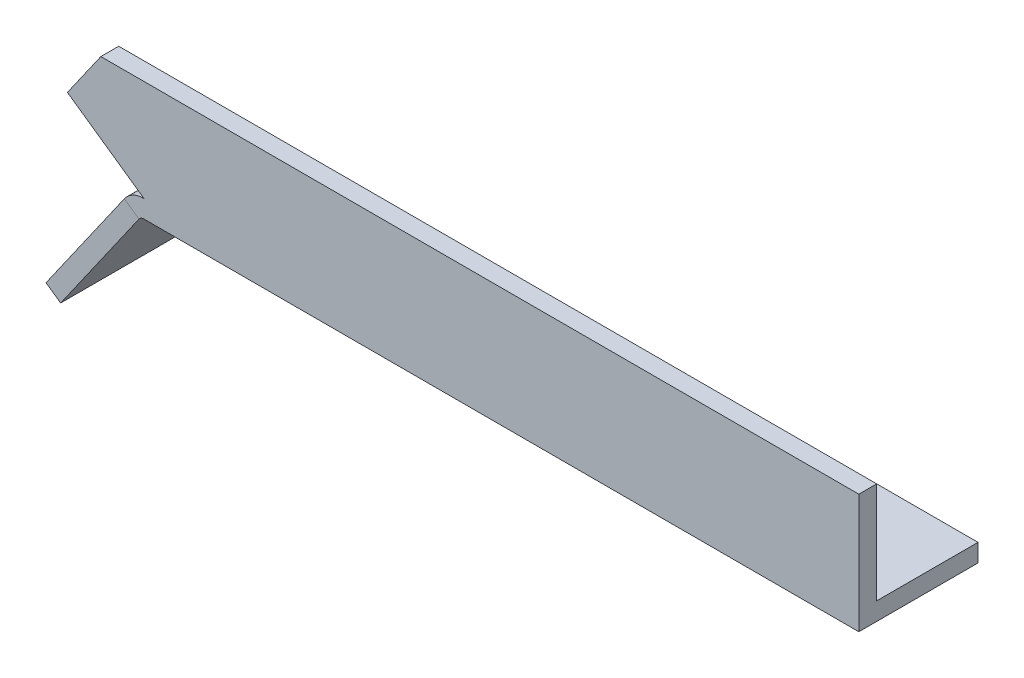
ISO-10303-21;
HEADER;
FILE_DESCRIPTION(('STEP AP214'),'2;1');
FILE_NAME('part.step','',(''),(''),'','','');
FILE_SCHEMA(('AUTOMOTIVE_DESIGN { 1 0 10303 214 1 1 1 1 }'));
ENDSEC;
DATA;
#1=APPLICATION_CONTEXT('core data for automotive mechanical design processes');
#2=APPLICATION_PROTOCOL_DEFINITION('international standard','automotive_design',2000,#1);
#3=PRODUCT_CONTEXT('',#1,'mechanical');
#4=PRODUCT('Part','Part','',(#3));
#5=PRODUCT_RELATED_PRODUCT_CATEGORY('part','',(#4));
#6=PRODUCT_DEFINITION_FORMATION('','',#4);
#7=PRODUCT_DEFINITION_CONTEXT('part definition',#1,'design');
#8=PRODUCT_DEFINITION('design','',#6,#7);
#9=PRODUCT_DEFINITION_SHAPE('','',#8);
#10=(LENGTH_UNIT() NAMED_UNIT(*) SI_UNIT(.MILLI.,.METRE.));
#11=(NAMED_UNIT(*) PLANE_ANGLE_UNIT() SI_UNIT($,.RADIAN.));
#12=(NAMED_UNIT(*) SI_UNIT($,.STERADIAN.) SOLID_ANGLE_UNIT());
#13=UNCERTAINTY_MEASURE_WITH_UNIT(LENGTH_MEASURE(1.E-05),#10,'distance_accuracy_value','');
#14=(GEOMETRIC_REPRESENTATION_CONTEXT(3) GLOBAL_UNCERTAINTY_ASSIGNED_CONTEXT((#13)) GLOBAL_UNIT_ASSIGNED_CONTEXT((#10,
#11,#12)) REPRESENTATION_CONTEXT('',''));
#15=CARTESIAN_POINT('',(0.,0.,0.));
#16=DIRECTION('',(0.,0.,1.));
#17=DIRECTION('',(1.,0.,0.));
#18=AXIS2_PLACEMENT_3D('',#15,#16,#17);
#19=CARTESIAN_POINT('',(120.,0.,0.));
#20=DIRECTION('',(0.,1.,0.));
#21=DIRECTION('',(0.,0.,1.));
#22=AXIS2_PLACEMENT_3D('',#19,#20,#21);
#23=PLANE('',#22);
#24=DIRECTION('',(0.,0.,-1.));
#25=VECTOR('',#24,1.);
#26=CARTESIAN_POINT('',(0.,0.,0.));
#27=LINE('',#26,#25);
#28=CARTESIAN_POINT('',(0.,0.,0.));
#29=VERTEX_POINT('',#28);
#30=CARTESIAN_POINT('',(0.,0.,-20.));
#31=VERTEX_POINT('',#30);
#32=EDGE_CURVE('E244',#29,#31,#27,.T.);
#33=ORIENTED_EDGE('',*,*,#32,.T.);
#34=DIRECTION('',(-1.,0.,0.));
#35=VECTOR('',#34,1.);
#36=CARTESIAN_POINT('',(120.,0.,-20.));
#37=LINE('',#36,#35);
#38=CARTESIAN_POINT('',(120.,0.,-20.));
#39=VERTEX_POINT('',#38);
#40=EDGE_CURVE('E13',#39,#31,#37,.T.);
#41=ORIENTED_EDGE('',*,*,#40,.F.);
#42=DIRECTION('',(0.,0.,-1.));
#43=VECTOR('',#42,1.);
#44=CARTESIAN_POINT('',(120.,0.,0.));
#45=LINE('',#44,#43);
#46=CARTESIAN_POINT('',(120.,0.,0.));
#47=VERTEX_POINT('',#46);
#48=EDGE_CURVE('E250',#47,#39,#45,.T.);
#49=ORIENTED_EDGE('',*,*,#48,.F.);
#50=DIRECTION('',(-1.,0.,0.));
#51=VECTOR('',#50,1.);
#52=CARTESIAN_POINT('',(120.,0.,0.));
#53=LINE('',#52,#51);
#54=EDGE_CURVE('E270',#47,#29,#53,.T.);
#55=ORIENTED_EDGE('',*,*,#54,.T.);
#56=EDGE_LOOP('',(#33,#41,#49,#55));
#57=FACE_BOUND('',#56,.T.);
#58=ADVANCED_FACE('F62',(#57),#23,.F.);
#59=CARTESIAN_POINT('',(120.,3.,-20.));
#60=DIRECTION('',(0.,0.,-1.));
#61=DIRECTION('',(-1.,0.,0.));
#62=AXIS2_PLACEMENT_3D('',#59,#60,#61);
#63=PLANE('',#62);
#64=ORIENTED_EDGE('',*,*,#40,.T.);
#65=CARTESIAN_POINT('',(0.,-1.,-20.));
#66=DIRECTION('',(0.,0.,-1.));
#67=DIRECTION('',(0.,1.,0.));
#68=AXIS2_PLACEMENT_3D('',#65,#66,#67);
#69=CIRCLE('',#68,0.999999999999999);
#70=CARTESIAN_POINT('',(-0.819152044288989,-0.426423563648952,-20.));
#71=VERTEX_POINT('',#70);
#72=EDGE_CURVE('E166',#71,#31,#69,.T.);
#73=ORIENTED_EDGE('',*,*,#72,.F.);
#74=DIRECTION('',(-0.819152044288989,0.57357643635105,0.));
#75=VECTOR('',#74,1.);
#76=CARTESIAN_POINT('',(-0.819152044288989,-0.42642356364895,-20.));
#77=LINE('',#76,#75);
#78=CARTESIAN_POINT('',(-3.27660817715596,1.2943057454042,-20.));
#79=VERTEX_POINT('',#78);
#80=EDGE_CURVE('E164',#71,#79,#77,.T.);
#81=ORIENTED_EDGE('',*,*,#80,.T.);
#82=CARTESIAN_POINT('',(0.,-1.,-20.));
#83=DIRECTION('',(0.,0.,-1.));
#84=DIRECTION('',(0.,1.,0.));
#85=AXIS2_PLACEMENT_3D('',#82,#83,#84);
#86=CIRCLE('',#85,4.);
#87=CARTESIAN_POINT('',(0.,3.,-20.));
#88=VERTEX_POINT('',#87);
#89=EDGE_CURVE('E148',#79,#88,#86,.T.);
#90=ORIENTED_EDGE('',*,*,#89,.T.);
#91=DIRECTION('',(-1.,0.,0.));
#92=VECTOR('',#91,1.);
#93=CARTESIAN_POINT('',(120.,3.,-20.));
#94=LINE('',#93,#92);
#95=CARTESIAN_POINT('',(120.,3.,-20.));
#96=VERTEX_POINT('',#95);
#97=EDGE_CURVE('E70',#96,#88,#94,.T.);
#98=ORIENTED_EDGE('',*,*,#97,.F.);
#99=DIRECTION('',(0.,-1.,0.));
#100=VECTOR('',#99,1.);
#101=CARTESIAN_POINT('',(120.,3.,-20.));
#102=LINE('',#101,#100);
#103=EDGE_CURVE('E253',#96,#39,#102,.T.);
#104=ORIENTED_EDGE('',*,*,#103,.T.);
#105=EDGE_LOOP('',(#64,#73,#81,#90,#98,#104));
#106=FACE_BOUND('',#105,.T.);
#107=ADVANCED_FACE('F165',(#106),#63,.T.);
#108=CARTESIAN_POINT('',(120.,3.,0.));
#109=DIRECTION('',(0.,1.,0.));
#110=DIRECTION('',(0.,0.,1.));
#111=AXIS2_PLACEMENT_3D('',#108,#109,#110);
#112=PLANE('',#111);
#113=DIRECTION('',(0.,0.,-1.));
#114=VECTOR('',#113,1.);
#115=CARTESIAN_POINT('',(0.,3.,0.));
#116=LINE('',#115,#114);
#117=CARTESIAN_POINT('',(0.,3.,-3.));
#118=VERTEX_POINT('',#117);
#119=EDGE_CURVE('E155',#118,#88,#116,.T.);
#120=ORIENTED_EDGE('',*,*,#119,.F.);
#121=DIRECTION('',(-1.,0.,0.));
#122=VECTOR('',#121,1.);
#123=CARTESIAN_POINT('',(120.,3.,-3.));
#124=LINE('',#123,#122);
#125=CARTESIAN_POINT('',(120.,3.,-3.));
#126=VERTEX_POINT('',#125);
#127=EDGE_CURVE('E284',#126,#118,#124,.T.);
#128=ORIENTED_EDGE('',*,*,#127,.F.);
#129=DIRECTION('',(0.,0.,-1.));
#130=VECTOR('',#129,1.);
#131=CARTESIAN_POINT('',(120.,3.,0.));
#132=LINE('',#131,#130);
#133=EDGE_CURVE('E257',#126,#96,#132,.T.);
#134=ORIENTED_EDGE('',*,*,#133,.T.);
#135=ORIENTED_EDGE('',*,*,#97,.T.);
#136=EDGE_LOOP('',(#120,#128,#134,#135));
#137=FACE_BOUND('',#136,.T.);
#138=ADVANCED_FACE('F290',(#137),#112,.T.);
#139=CARTESIAN_POINT('',(120.,20.,-3.));
#140=DIRECTION('',(0.,0.,-1.));
#141=DIRECTION('',(0.,1.,0.));
#142=AXIS2_PLACEMENT_3D('',#139,#140,#141);
#143=PLANE('',#142);
#144=ORIENTED_EDGE('',*,*,#127,.T.);
#145=DIRECTION('',(0.819152044288995,-0.573576436351041,0.));
#146=VECTOR('',#145,1.);
#147=CARTESIAN_POINT('',(0.,3.,-3.));
#148=LINE('',#147,#146);
#149=CARTESIAN_POINT('',(-12.8297264950135,11.9834712049772,-3.));
#150=VERTEX_POINT('',#149);
#151=EDGE_CURVE('E228',#150,#118,#148,.T.);
#152=ORIENTED_EDGE('',*,*,#151,.F.);
#153=DIRECTION('',(-0.573576436351034,-0.819152044289,0.));
#154=VECTOR('',#153,1.);
#155=CARTESIAN_POINT('',(-12.8297264950135,11.9834712049772,-3.));
#156=LINE('',#155,#154);
#157=CARTESIAN_POINT('',(-7.21649260246355,20.,-3.));
#158=VERTEX_POINT('',#157);
#159=EDGE_CURVE('E224',#158,#150,#156,.T.);
#160=ORIENTED_EDGE('',*,*,#159,.F.);
#161=DIRECTION('',(-1.,0.,0.));
#162=VECTOR('',#161,1.);
#163=CARTESIAN_POINT('',(120.,20.,-3.));
#164=LINE('',#163,#162);
#165=CARTESIAN_POINT('',(120.,20.,-3.));
#166=VERTEX_POINT('',#165);
#167=EDGE_CURVE('E281',#166,#158,#164,.T.);
#168=ORIENTED_EDGE('',*,*,#167,.F.);
#169=DIRECTION('',(0.,-1.,0.));
#170=VECTOR('',#169,1.);
#171=CARTESIAN_POINT('',(120.,20.,-3.));
#172=LINE('',#171,#170);
#173=EDGE_CURVE('E261',#166,#126,#172,.T.);
#174=ORIENTED_EDGE('',*,*,#173,.T.);
#175=EDGE_LOOP('',(#144,#152,#160,#168,#174));
#176=FACE_BOUND('',#175,.T.);
#177=ADVANCED_FACE('F335',(#176),#143,.T.);
#178=CARTESIAN_POINT('',(120.,20.,0.));
#179=DIRECTION('',(0.,1.,0.));
#180=DIRECTION('',(0.,0.,1.));
#181=AXIS2_PLACEMENT_3D('',#178,#179,#180);
#182=PLANE('',#181);
#183=ORIENTED_EDGE('',*,*,#167,.T.);
#184=DIRECTION('',(0.,0.,1.));
#185=VECTOR('',#184,1.);
#186=CARTESIAN_POINT('',(-7.21649260246355,20.,-3.));
#187=LINE('',#186,#185);
#188=CARTESIAN_POINT('',(-7.21649260246355,20.,0.));
#189=VERTEX_POINT('',#188);
#190=EDGE_CURVE('E233',#158,#189,#187,.T.);
#191=ORIENTED_EDGE('',*,*,#190,.T.);
#192=DIRECTION('',(-1.,0.,0.));
#193=VECTOR('',#192,1.);
#194=CARTESIAN_POINT('',(120.,20.,0.));
#195=LINE('',#194,#193);
#196=CARTESIAN_POINT('',(120.,20.,0.));
#197=VERTEX_POINT('',#196);
#198=EDGE_CURVE('E85',#197,#189,#195,.T.);
#199=ORIENTED_EDGE('',*,*,#198,.F.);
#200=DIRECTION('',(0.,0.,-1.));
#201=VECTOR('',#200,1.);
#202=CARTESIAN_POINT('',(120.,20.,0.));
#203=LINE('',#202,#201);
#204=EDGE_CURVE('E265',#197,#166,#203,.T.);
#205=ORIENTED_EDGE('',*,*,#204,.T.);
#206=EDGE_LOOP('',(#183,#191,#199,#205));
#207=FACE_BOUND('',#206,.T.);
#208=ADVANCED_FACE('F340',(#207),#182,.T.);
#209=CARTESIAN_POINT('',(120.,20.,0.));
#210=DIRECTION('',(0.,0.,-1.));
#211=DIRECTION('',(0.,1.,0.));
#212=AXIS2_PLACEMENT_3D('',#209,#210,#211);
#213=PLANE('',#212);
#214=ORIENTED_EDGE('',*,*,#54,.F.);
#215=DIRECTION('',(0.,-1.,0.));
#216=VECTOR('',#215,1.);
#217=CARTESIAN_POINT('',(120.,20.,0.));
#218=LINE('',#217,#216);
#219=EDGE_CURVE('E77',#197,#47,#218,.T.);
#220=ORIENTED_EDGE('',*,*,#219,.F.);
#221=ORIENTED_EDGE('',*,*,#198,.T.);
#222=DIRECTION('',(-0.573576436351034,-0.819152044289,0.));
#223=VECTOR('',#222,1.);
#224=CARTESIAN_POINT('',(-12.8297264950135,11.9834712049772,0.));
#225=LINE('',#224,#223);
#226=CARTESIAN_POINT('',(-12.8297264950135,11.9834712049772,0.));
#227=VERTEX_POINT('',#226);
#228=EDGE_CURVE('E217',#189,#227,#225,.T.);
#229=ORIENTED_EDGE('',*,*,#228,.T.);
#230=DIRECTION('',(0.819152044288995,-0.573576436351041,0.));
#231=VECTOR('',#230,1.);
#232=CARTESIAN_POINT('',(0.,3.,0.));
#233=LINE('',#232,#231);
#234=CARTESIAN_POINT('',(0.,3.,0.));
#235=VERTEX_POINT('',#234);
#236=EDGE_CURVE('E229',#227,#235,#233,.T.);
#237=ORIENTED_EDGE('',*,*,#236,.T.);
#238=CARTESIAN_POINT('',(0.,-0.999999999999999,0.));
#239=DIRECTION('',(0.,0.,-1.));
#240=DIRECTION('',(0.,1.,0.));
#241=AXIS2_PLACEMENT_3D('',#238,#239,#240);
#242=CIRCLE('',#241,4.);
#243=CARTESIAN_POINT('',(-3.27660817715596,1.2943057454042,0.));
#244=VERTEX_POINT('',#243);
#245=EDGE_CURVE('E159',#235,#244,#242,.F.);
#246=ORIENTED_EDGE('',*,*,#245,.T.);
#247=DIRECTION('',(-0.819152044288989,0.57357643635105,0.));
#248=VECTOR('',#247,1.);
#249=CARTESIAN_POINT('',(-3.27660817715596,1.2943057454042,0.));
#250=LINE('',#249,#248);
#251=CARTESIAN_POINT('',(-0.819152044288989,-0.426423563648949,0.));
#252=VERTEX_POINT('',#251);
#253=EDGE_CURVE('E212',#252,#244,#250,.T.);
#254=ORIENTED_EDGE('',*,*,#253,.F.);
#255=CARTESIAN_POINT('',(0.,-0.999999999999999,0.));
#256=DIRECTION('',(0.,0.,-1.));
#257=DIRECTION('',(0.,1.,0.));
#258=AXIS2_PLACEMENT_3D('',#255,#256,#257);
#259=CIRCLE('',#258,0.999999999999999);
#260=EDGE_CURVE('E160',#29,#252,#259,.F.);
#261=ORIENTED_EDGE('',*,*,#260,.F.);
#262=EDGE_LOOP('',(#214,#220,#221,#229,#237,#246,#254,#261));
#263=FACE_BOUND('',#262,.T.);
#264=ADVANCED_FACE('F303',(#263),#213,.F.);
#265=CARTESIAN_POINT('',(120.,0.,0.));
#266=DIRECTION('',(-1.,0.,0.));
#267=DIRECTION('',(0.,0.,1.));
#268=AXIS2_PLACEMENT_3D('',#265,#266,#267);
#269=PLANE('',#268);
#270=ORIENTED_EDGE('',*,*,#133,.F.);
#271=ORIENTED_EDGE('',*,*,#173,.F.);
#272=ORIENTED_EDGE('',*,*,#204,.F.);
#273=ORIENTED_EDGE('',*,*,#219,.T.);
#274=ORIENTED_EDGE('',*,*,#48,.T.);
#275=ORIENTED_EDGE('',*,*,#103,.F.);
#276=EDGE_LOOP('',(#270,#271,#272,#273,#274,#275));
#277=FACE_BOUND('',#276,.T.);
#278=ADVANCED_FACE('F293',(#277),#269,.F.);
#279=CARTESIAN_POINT('',(0.,3.,-3.));
#280=DIRECTION('',(-0.573576436351041,-0.819152044288995,0.));
#281=DIRECTION('',(0.819152044288995,-0.573576436351041,0.));
#282=AXIS2_PLACEMENT_3D('',#279,#280,#281);
#283=PLANE('',#282);
#284=ORIENTED_EDGE('',*,*,#236,.F.);
#285=DIRECTION('',(0.,0.,1.));
#286=VECTOR('',#285,1.);
#287=CARTESIAN_POINT('',(-12.8297264950135,11.9834712049772,-3.));
#288=LINE('',#287,#286);
#289=EDGE_CURVE('E245',#150,#227,#288,.T.);
#290=ORIENTED_EDGE('',*,*,#289,.F.);
#291=ORIENTED_EDGE('',*,*,#151,.T.);
#292=DIRECTION('',(0.,0.,1.));
#293=VECTOR('',#292,1.);
#294=CARTESIAN_POINT('',(0.,3.,-3.));
#295=LINE('',#294,#293);
#296=EDGE_CURVE('E240',#118,#235,#295,.T.);
#297=ORIENTED_EDGE('',*,*,#296,.T.);
#298=EDGE_LOOP('',(#284,#290,#291,#297));
#299=FACE_BOUND('',#298,.T.);
#300=ADVANCED_FACE('F348',(#299),#283,.T.);
#301=CARTESIAN_POINT('',(-12.8297264950135,11.9834712049772,-3.));
#302=DIRECTION('',(-0.819152044289,0.573576436351034,0.));
#303=DIRECTION('',(-0.573576436351034,-0.819152044289001,0.));
#304=AXIS2_PLACEMENT_3D('',#301,#302,#303);
#305=PLANE('',#304);
#306=ORIENTED_EDGE('',*,*,#228,.F.);
#307=ORIENTED_EDGE('',*,*,#190,.F.);
#308=ORIENTED_EDGE('',*,*,#159,.T.);
#309=ORIENTED_EDGE('',*,*,#289,.T.);
#310=EDGE_LOOP('',(#306,#307,#308,#309));
#311=FACE_BOUND('',#310,.T.);
#312=ADVANCED_FACE('F349',(#311),#305,.T.);
#313=CARTESIAN_POINT('',(0.,-1.,-20.));
#314=DIRECTION('',(0.,0.,-1.));
#315=DIRECTION('',(-0.819152044288989,0.57357643635105,0.));
#316=AXIS2_PLACEMENT_3D('',#313,#314,#315);
#317=CYLINDRICAL_SURFACE('',#316,4.);
#318=ORIENTED_EDGE('',*,*,#296,.F.);
#319=ORIENTED_EDGE('',*,*,#119,.T.);
#320=ORIENTED_EDGE('',*,*,#89,.F.);
#321=DIRECTION('',(0.,0.,-1.));
#322=VECTOR('',#321,1.);
#323=CARTESIAN_POINT('',(-3.27660817715596,1.2943057454042,0.));
#324=LINE('',#323,#322);
#325=EDGE_CURVE('E152',#244,#79,#324,.T.);
#326=ORIENTED_EDGE('',*,*,#325,.F.);
#327=ORIENTED_EDGE('',*,*,#245,.F.);
#328=EDGE_LOOP('',(#318,#319,#320,#326,#327));
#329=FACE_BOUND('',#328,.T.);
#330=ADVANCED_FACE('F150',(#329),#317,.T.);
#331=CARTESIAN_POINT('',(0.,-1.,-20.));
#332=DIRECTION('',(0.,0.,-1.));
#333=DIRECTION('',(-0.819152044288989,0.57357643635105,0.));
#334=AXIS2_PLACEMENT_3D('',#331,#332,#333);
#335=CYLINDRICAL_SURFACE('',#334,0.999999999999999);
#336=ORIENTED_EDGE('',*,*,#32,.F.);
#337=ORIENTED_EDGE('',*,*,#260,.T.);
#338=DIRECTION('',(0.,0.,1.));
#339=VECTOR('',#338,1.);
#340=CARTESIAN_POINT('',(-0.819152044288989,-0.42642356364895,0.));
#341=LINE('',#340,#339);
#342=EDGE_CURVE('E172',#252,#71,#341,.F.);
#343=ORIENTED_EDGE('',*,*,#342,.T.);
#344=ORIENTED_EDGE('',*,*,#72,.T.);
#345=EDGE_LOOP('',(#336,#337,#343,#344));
#346=FACE_BOUND('',#345,.T.);
#347=ADVANCED_FACE('F300',(#346),#335,.F.);
#348=CARTESIAN_POINT('',(-2.97802318341871,1.72072930905315,-20.));
#349=DIRECTION('',(0.,0.,-1.));
#350=DIRECTION('',(-1.,0.,0.));
#351=AXIS2_PLACEMENT_3D('',#348,#349,#350);
#352=PLANE('',#351);
#353=DIRECTION('',(0.57357643635105,0.819152044288989,0.));
#354=VECTOR('',#353,1.);
#355=CARTESIAN_POINT('',(-2.97802318341871,1.72072930905315,-20.));
#356=LINE('',#355,#354);
#357=CARTESIAN_POINT('',(-16.4216791109832,-17.4788011072247,-20.));
#358=VERTEX_POINT('',#357);
#359=EDGE_CURVE('E179',#358,#79,#356,.T.);
#360=ORIENTED_EDGE('',*,*,#359,.T.);
#361=ORIENTED_EDGE('',*,*,#80,.F.);
#362=DIRECTION('',(-0.57357643635105,-0.819152044288989,0.));
#363=VECTOR('',#362,1.);
#364=CARTESIAN_POINT('',(-0.520567050551743,0.,-20.));
#365=LINE('',#364,#363);
#366=CARTESIAN_POINT('',(-13.9642229781163,-19.1995304162779,-20.));
#367=VERTEX_POINT('',#366);
#368=EDGE_CURVE('E201',#367,#71,#365,.F.);
#369=ORIENTED_EDGE('',*,*,#368,.F.);
#370=DIRECTION('',(0.819152044288989,-0.57357643635105,0.));
#371=VECTOR('',#370,1.);
#372=CARTESIAN_POINT('',(-16.4216791109832,-17.4788011072247,-20.));
#373=LINE('',#372,#371);
#374=EDGE_CURVE('E185',#358,#367,#373,.T.);
#375=ORIENTED_EDGE('',*,*,#374,.F.);
#376=EDGE_LOOP('',(#360,#361,#369,#375));
#377=FACE_BOUND('',#376,.T.);
#378=ADVANCED_FACE('F184',(#377),#352,.T.);
#379=CARTESIAN_POINT('',(-16.4216791109832,-17.4788011072247,0.));
#380=DIRECTION('',(0.,0.,1.));
#381=DIRECTION('',(1.,0.,0.));
#382=AXIS2_PLACEMENT_3D('',#379,#380,#381);
#383=PLANE('',#382);
#384=DIRECTION('',(0.57357643635105,0.819152044288989,0.));
#385=VECTOR('',#384,1.);
#386=CARTESIAN_POINT('',(-0.520567050551743,0.,0.));
#387=LINE('',#386,#385);
#388=CARTESIAN_POINT('',(-13.9642229781162,-19.1995304162779,0.));
#389=VERTEX_POINT('',#388);
#390=EDGE_CURVE('E182',#252,#389,#387,.F.);
#391=ORIENTED_EDGE('',*,*,#390,.F.);
#392=ORIENTED_EDGE('',*,*,#253,.T.);
#393=DIRECTION('',(-0.57357643635105,-0.819152044288989,0.));
#394=VECTOR('',#393,1.);
#395=CARTESIAN_POINT('',(-16.4216791109832,-17.4788011072247,0.));
#396=LINE('',#395,#394);
#397=CARTESIAN_POINT('',(-16.4216791109832,-17.4788011072247,0.));
#398=VERTEX_POINT('',#397);
#399=EDGE_CURVE('E180',#244,#398,#396,.T.);
#400=ORIENTED_EDGE('',*,*,#399,.T.);
#401=DIRECTION('',(0.819152044288989,-0.57357643635105,0.));
#402=VECTOR('',#401,1.);
#403=CARTESIAN_POINT('',(-16.4216791109832,-17.4788011072247,0.));
#404=LINE('',#403,#402);
#405=EDGE_CURVE('E188',#398,#389,#404,.T.);
#406=ORIENTED_EDGE('',*,*,#405,.T.);
#407=EDGE_LOOP('',(#391,#392,#400,#406));
#408=FACE_BOUND('',#407,.T.);
#409=ADVANCED_FACE('F306',(#408),#383,.T.);
#410=CARTESIAN_POINT('',(-2.97802318341871,1.72072930905315,0.));
#411=DIRECTION('',(-0.819152044288989,0.57357643635105,0.));
#412=DIRECTION('',(-0.57357643635105,-0.819152044288989,0.));
#413=AXIS2_PLACEMENT_3D('',#410,#411,#412);
#414=PLANE('',#413);
#415=ORIENTED_EDGE('',*,*,#399,.F.);
#416=ORIENTED_EDGE('',*,*,#325,.T.);
#417=ORIENTED_EDGE('',*,*,#359,.F.);
#418=DIRECTION('',(0.,0.,-1.));
#419=VECTOR('',#418,1.);
#420=CARTESIAN_POINT('',(-16.4216791109832,-17.4788011072247,-20.));
#421=LINE('',#420,#419);
#422=EDGE_CURVE('E189',#398,#358,#421,.T.);
#423=ORIENTED_EDGE('',*,*,#422,.F.);
#424=EDGE_LOOP('',(#415,#416,#417,#423));
#425=FACE_BOUND('',#424,.T.);
#426=ADVANCED_FACE('F177',(#425),#414,.T.);
#427=CARTESIAN_POINT('',(-0.520567050551743,0.,0.));
#428=DIRECTION('',(-0.819152044288989,0.57357643635105,0.));
#429=DIRECTION('',(-0.57357643635105,-0.819152044288989,0.));
#430=AXIS2_PLACEMENT_3D('',#427,#428,#429);
#431=PLANE('',#430);
#432=ORIENTED_EDGE('',*,*,#342,.F.);
#433=ORIENTED_EDGE('',*,*,#390,.T.);
#434=DIRECTION('',(0.,0.,1.));
#435=VECTOR('',#434,1.);
#436=CARTESIAN_POINT('',(-13.9642229781163,-19.1995304162779,0.));
#437=LINE('',#436,#435);
#438=EDGE_CURVE('E204',#389,#367,#437,.F.);
#439=ORIENTED_EDGE('',*,*,#438,.T.);
#440=ORIENTED_EDGE('',*,*,#368,.T.);
#441=EDGE_LOOP('',(#432,#433,#439,#440));
#442=FACE_BOUND('',#441,.T.);
#443=ADVANCED_FACE('F310',(#442),#431,.F.);
#444=CARTESIAN_POINT('',(-16.4216791109832,-17.4788011072247,-20.));
#445=DIRECTION('',(-0.57357643635105,-0.819152044288989,0.));
#446=DIRECTION('',(0.819152044288989,-0.57357643635105,0.));
#447=AXIS2_PLACEMENT_3D('',#444,#445,#446);
#448=PLANE('',#447);
#449=ORIENTED_EDGE('',*,*,#438,.F.);
#450=ORIENTED_EDGE('',*,*,#405,.F.);
#451=ORIENTED_EDGE('',*,*,#422,.T.);
#452=ORIENTED_EDGE('',*,*,#374,.T.);
#453=EDGE_LOOP('',(#449,#450,#451,#452));
#454=FACE_BOUND('',#453,.T.);
#455=ADVANCED_FACE('F312',(#454),#448,.T.);
#456=CLOSED_SHELL('',(#58,#107,#138,#177,#208,#264,#278,#300,#312,#330,#347,#378,#409,#426,#443,#455));
#457=MANIFOLD_SOLID_BREP('B2',#456);
#458=ADVANCED_BREP_SHAPE_REPRESENTATION('',(#18,#457),#14);
#459=SHAPE_DEFINITION_REPRESENTATION(#9,#458);
ENDSEC;
END-ISO-10303-21;
